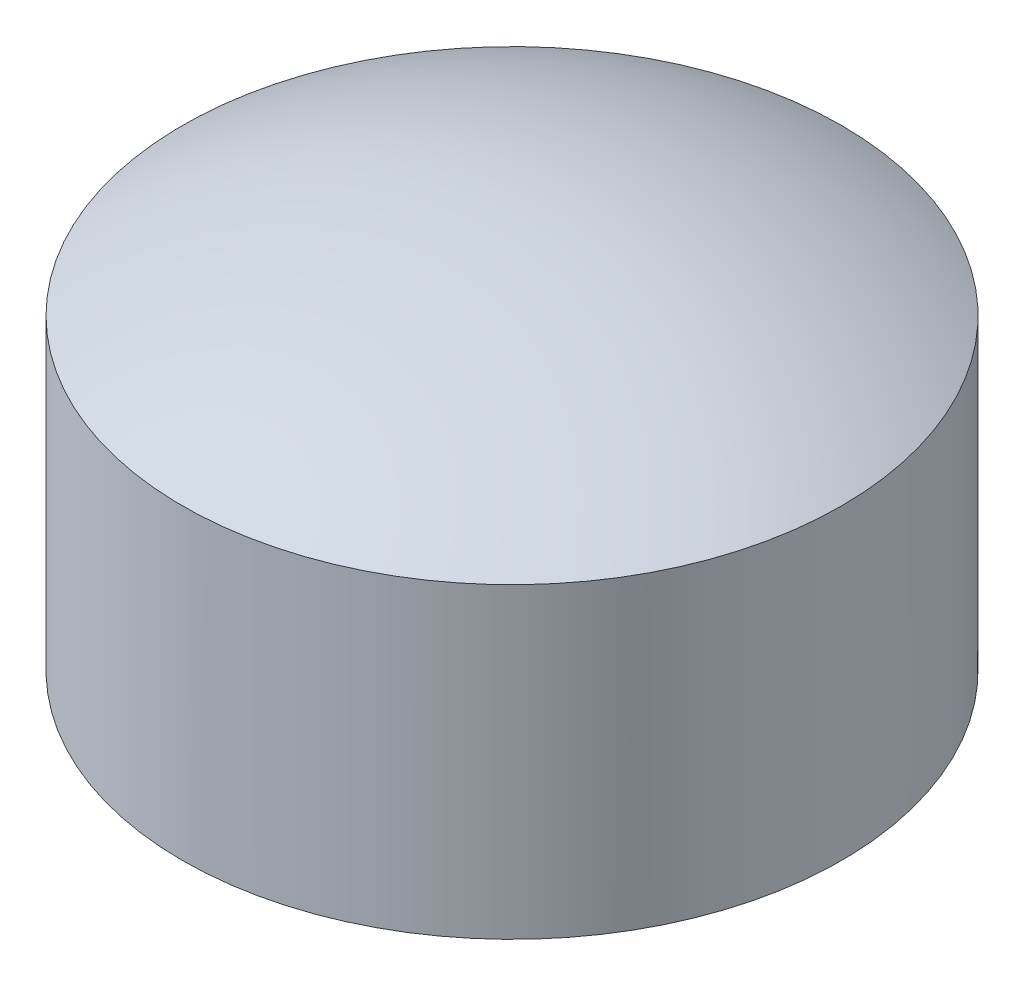
ISO-10303-21;
HEADER;
FILE_DESCRIPTION(('STEP AP214'),'2;1');
FILE_NAME('part.step','',(''),(''),'','','');
FILE_SCHEMA(('AUTOMOTIVE_DESIGN { 1 0 10303 214 1 1 1 1 }'));
ENDSEC;
DATA;
#1=APPLICATION_CONTEXT('core data for automotive mechanical design processes');
#2=APPLICATION_PROTOCOL_DEFINITION('international standard','automotive_design',2000,#1);
#3=PRODUCT_CONTEXT('',#1,'mechanical');
#4=PRODUCT('Part','Part','',(#3));
#5=PRODUCT_RELATED_PRODUCT_CATEGORY('part','',(#4));
#6=PRODUCT_DEFINITION_FORMATION('','',#4);
#7=PRODUCT_DEFINITION_CONTEXT('part definition',#1,'design');
#8=PRODUCT_DEFINITION('design','',#6,#7);
#9=PRODUCT_DEFINITION_SHAPE('','',#8);
#10=(LENGTH_UNIT() NAMED_UNIT(*) SI_UNIT(.MILLI.,.METRE.));
#11=(NAMED_UNIT(*) PLANE_ANGLE_UNIT() SI_UNIT($,.RADIAN.));
#12=(NAMED_UNIT(*) SI_UNIT($,.STERADIAN.) SOLID_ANGLE_UNIT());
#13=UNCERTAINTY_MEASURE_WITH_UNIT(LENGTH_MEASURE(1.E-05),#10,'distance_accuracy_value','');
#14=(GEOMETRIC_REPRESENTATION_CONTEXT(3) GLOBAL_UNCERTAINTY_ASSIGNED_CONTEXT((#13)) GLOBAL_UNIT_ASSIGNED_CONTEXT((#10,
#11,#12)) REPRESENTATION_CONTEXT('',''));
#15=CARTESIAN_POINT('',(0.,0.,0.));
#16=DIRECTION('',(0.,0.,1.));
#17=DIRECTION('',(1.,0.,0.));
#18=AXIS2_PLACEMENT_3D('',#15,#16,#17);
#19=CARTESIAN_POINT('',(0.,8.,0.));
#20=DIRECTION('',(0.,-1.,0.));
#21=DIRECTION('',(0.,0.,-1.));
#22=AXIS2_PLACEMENT_3D('',#19,#20,#21);
#23=CYLINDRICAL_SURFACE('',#22,5.);
#24=CARTESIAN_POINT('',(0.,22.6602540378444,0.));
#25=DIRECTION('',(0.,-1.,0.));
#26=DIRECTION('',(0.,0.,-1.));
#27=AXIS2_PLACEMENT_3D('',#24,#25,#26);
#28=CIRCLE('',#27,5.);
#29=CARTESIAN_POINT('',(0.,22.6602540378444,-5.));
#30=VERTEX_POINT('',#29);
#31=EDGE_CURVE('E10',#30,#30,#28,.T.);
#32=ORIENTED_EDGE('',*,*,#31,.T.);
#33=EDGE_LOOP('',(#32));
#34=FACE_BOUND('',#33,.T.);
#35=CARTESIAN_POINT('',(0.,18.,0.));
#36=DIRECTION('',(0.,-1.,0.));
#37=DIRECTION('',(0.,0.,-1.));
#38=AXIS2_PLACEMENT_3D('',#35,#36,#37);
#39=CIRCLE('',#38,5.);
#40=CARTESIAN_POINT('',(0.,18.,-5.));
#41=VERTEX_POINT('',#40);
#42=EDGE_CURVE('E44',#41,#41,#39,.T.);
#43=ORIENTED_EDGE('',*,*,#42,.F.);
#44=EDGE_LOOP('',(#43));
#45=FACE_BOUND('',#44,.T.);
#46=ADVANCED_FACE('F37',(#34,#45),#23,.T.);
#47=CARTESIAN_POINT('',(0.,14.,0.));
#48=DIRECTION('',(0.,1.,0.));
#49=DIRECTION('',(1.,0.,0.));
#50=AXIS2_PLACEMENT_3D('',#47,#48,#49);
#51=SPHERICAL_SURFACE('',#50,10.);
#52=ORIENTED_EDGE('',*,*,#31,.F.);
#53=EDGE_LOOP('',(#52));
#54=FACE_BOUND('',#53,.T.);
#55=ADVANCED_FACE('F54',(#54),#51,.T.);
#56=CARTESIAN_POINT('',(0.,18.,0.));
#57=DIRECTION('',(0.,-1.,0.));
#58=DIRECTION('',(0.,0.,-1.));
#59=AXIS2_PLACEMENT_3D('',#56,#57,#58);
#60=PLANE('',#59);
#61=ORIENTED_EDGE('',*,*,#42,.T.);
#62=EDGE_LOOP('',(#61));
#63=FACE_BOUND('',#62,.T.);
#64=ADVANCED_FACE('F51',(#63),#60,.T.);
#65=CLOSED_SHELL('',(#46,#55,#64));
#66=MANIFOLD_SOLID_BREP('B2',#65);
#67=ADVANCED_BREP_SHAPE_REPRESENTATION('',(#18,#66),#14);
#68=SHAPE_DEFINITION_REPRESENTATION(#9,#67);
ENDSEC;
END-ISO-10303-21;
